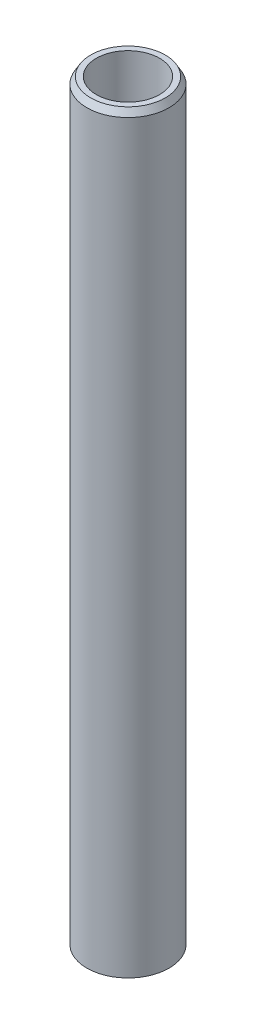
ISO-10303-21;
HEADER;
FILE_DESCRIPTION(('STEP AP214'),'2;1');
FILE_NAME('part.step','',(''),(''),'','','');
FILE_SCHEMA(('AUTOMOTIVE_DESIGN { 1 0 10303 214 1 1 1 1 }'));
ENDSEC;
DATA;
#1=APPLICATION_CONTEXT('core data for automotive mechanical design processes');
#2=APPLICATION_PROTOCOL_DEFINITION('international standard','automotive_design',2000,#1);
#3=PRODUCT_CONTEXT('',#1,'mechanical');
#4=PRODUCT('Part','Part','',(#3));
#5=PRODUCT_RELATED_PRODUCT_CATEGORY('part','',(#4));
#6=PRODUCT_DEFINITION_FORMATION('','',#4);
#7=PRODUCT_DEFINITION_CONTEXT('part definition',#1,'design');
#8=PRODUCT_DEFINITION('design','',#6,#7);
#9=PRODUCT_DEFINITION_SHAPE('','',#8);
#10=(LENGTH_UNIT() NAMED_UNIT(*) SI_UNIT(.MILLI.,.METRE.));
#11=(NAMED_UNIT(*) PLANE_ANGLE_UNIT() SI_UNIT($,.RADIAN.));
#12=(NAMED_UNIT(*) SI_UNIT($,.STERADIAN.) SOLID_ANGLE_UNIT());
#13=UNCERTAINTY_MEASURE_WITH_UNIT(LENGTH_MEASURE(1.E-05),#10,'distance_accuracy_value','');
#14=(GEOMETRIC_REPRESENTATION_CONTEXT(3) GLOBAL_UNCERTAINTY_ASSIGNED_CONTEXT((#13)) GLOBAL_UNIT_ASSIGNED_CONTEXT((#10,
#11,#12)) REPRESENTATION_CONTEXT('',''));
#15=CARTESIAN_POINT('',(0.,0.,0.));
#16=DIRECTION('',(0.,0.,1.));
#17=DIRECTION('',(1.,0.,0.));
#18=AXIS2_PLACEMENT_3D('',#15,#16,#17);
#19=CARTESIAN_POINT('',(0.,321.885524198242,0.));
#20=DIRECTION('',(0.,-1.,0.));
#21=DIRECTION('',(0.,0.,-1.));
#22=AXIS2_PLACEMENT_3D('',#19,#20,#21);
#23=CYLINDRICAL_SURFACE('',#22,17.5);
#24=CARTESIAN_POINT('',(0.,319.067785620837,0.));
#25=DIRECTION('',(0.,1.,0.));
#26=DIRECTION('',(0.,0.,1.));
#27=AXIS2_PLACEMENT_3D('',#24,#25,#26);
#28=CIRCLE('',#27,17.5);
#29=CARTESIAN_POINT('',(0.,319.067785620837,17.5));
#30=VERTEX_POINT('',#29);
#31=EDGE_CURVE('E50',#30,#30,#28,.F.);
#32=ORIENTED_EDGE('',*,*,#31,.T.);
#33=EDGE_LOOP('',(#32));
#34=FACE_BOUND('',#33,.T.);
#35=CARTESIAN_POINT('',(0.,1.62682212617055,0.));
#36=DIRECTION('',(0.,1.,0.));
#37=DIRECTION('',(0.,0.,1.));
#38=AXIS2_PLACEMENT_3D('',#35,#36,#37);
#39=CIRCLE('',#38,17.5);
#40=CARTESIAN_POINT('',(0.,1.62682212617055,17.5));
#41=VERTEX_POINT('',#40);
#42=EDGE_CURVE('E51',#41,#41,#39,.T.);
#43=ORIENTED_EDGE('',*,*,#42,.T.);
#44=EDGE_LOOP('',(#43));
#45=FACE_BOUND('',#44,.T.);
#46=ADVANCED_FACE('F39',(#34,#45),#23,.T.);
#47=CARTESIAN_POINT('',(0.,321.885524198242,0.));
#48=DIRECTION('',(0.,1.,0.));
#49=DIRECTION('',(0.,0.,1.));
#50=AXIS2_PLACEMENT_3D('',#47,#48,#49);
#51=PLANE('',#50);
#52=CARTESIAN_POINT('',(0.,321.885524198242,0.));
#53=DIRECTION('',(0.,1.,0.));
#54=DIRECTION('',(0.,0.,1.));
#55=AXIS2_PLACEMENT_3D('',#52,#53,#54);
#56=CIRCLE('',#55,15.8731778738294);
#57=CARTESIAN_POINT('',(0.,321.885524198242,15.8731778738294));
#58=VERTEX_POINT('',#57);
#59=EDGE_CURVE('E54',#58,#58,#56,.T.);
#60=ORIENTED_EDGE('',*,*,#59,.T.);
#61=EDGE_LOOP('',(#60));
#62=FACE_BOUND('',#61,.T.);
#63=CARTESIAN_POINT('',(0.,321.885524198242,0.));
#64=DIRECTION('',(0.,1.,0.));
#65=DIRECTION('',(0.,0.,1.));
#66=AXIS2_PLACEMENT_3D('',#63,#64,#65);
#67=CIRCLE('',#66,13.4563874358037);
#68=CARTESIAN_POINT('',(0.,321.885524198242,13.4563874358037));
#69=VERTEX_POINT('',#68);
#70=EDGE_CURVE('E58',#69,#69,#67,.T.);
#71=ORIENTED_EDGE('',*,*,#70,.F.);
#72=EDGE_LOOP('',(#71));
#73=FACE_BOUND('',#72,.T.);
#74=ADVANCED_FACE('F69',(#62,#73),#51,.T.);
#75=CARTESIAN_POINT('',(0.,0.,0.));
#76=DIRECTION('',(0.,1.,0.));
#77=DIRECTION('',(0.,0.,1.));
#78=AXIS2_PLACEMENT_3D('',#75,#76,#77);
#79=PLANE('',#78);
#80=CARTESIAN_POINT('',(0.,0.,0.));
#81=DIRECTION('',(0.,1.,0.));
#82=DIRECTION('',(0.,0.,1.));
#83=AXIS2_PLACEMENT_3D('',#80,#81,#82);
#84=CIRCLE('',#83,14.6822614225954);
#85=CARTESIAN_POINT('',(0.,0.,14.6822614225954));
#86=VERTEX_POINT('',#85);
#87=EDGE_CURVE('E10',#86,#86,#84,.F.);
#88=ORIENTED_EDGE('',*,*,#87,.T.);
#89=EDGE_LOOP('',(#88));
#90=FACE_BOUND('',#89,.T.);
#91=CARTESIAN_POINT('',(0.,0.,0.));
#92=DIRECTION('',(0.,1.,0.));
#93=DIRECTION('',(0.,0.,1.));
#94=AXIS2_PLACEMENT_3D('',#91,#92,#93);
#95=CIRCLE('',#94,13.4563874358037);
#96=CARTESIAN_POINT('',(0.,0.,13.4563874358037));
#97=VERTEX_POINT('',#96);
#98=EDGE_CURVE('E63',#97,#97,#95,.T.);
#99=ORIENTED_EDGE('',*,*,#98,.T.);
#100=EDGE_LOOP('',(#99));
#101=FACE_BOUND('',#100,.T.);
#102=ADVANCED_FACE('F75',(#90,#101),#79,.F.);
#103=CARTESIAN_POINT('',(0.,321.885524198242,0.));
#104=DIRECTION('',(0.,-1.,0.));
#105=DIRECTION('',(0.,0.,-1.));
#106=AXIS2_PLACEMENT_3D('',#103,#104,#105);
#107=CYLINDRICAL_SURFACE('',#106,13.4563874358037);
#108=ORIENTED_EDGE('',*,*,#70,.T.);
#109=EDGE_LOOP('',(#108));
#110=FACE_BOUND('',#109,.T.);
#111=ORIENTED_EDGE('',*,*,#98,.F.);
#112=EDGE_LOOP('',(#111));
#113=FACE_BOUND('',#112,.T.);
#114=ADVANCED_FACE('F70',(#110,#113),#107,.F.);
#115=CARTESIAN_POINT('',(0.,321.885524198242,0.));
#116=DIRECTION('',(0.,-1.,0.));
#117=DIRECTION('',(0.,0.,-1.));
#118=AXIS2_PLACEMENT_3D('',#115,#116,#117);
#119=CONICAL_SURFACE('',#118,15.8731778738294,0.523598775598306);
#120=ORIENTED_EDGE('',*,*,#31,.F.);
#121=EDGE_LOOP('',(#120));
#122=FACE_BOUND('',#121,.T.);
#123=ORIENTED_EDGE('',*,*,#59,.F.);
#124=EDGE_LOOP('',(#123));
#125=FACE_BOUND('',#124,.T.);
#126=ADVANCED_FACE('F81',(#122,#125),#119,.T.);
#127=CARTESIAN_POINT('',(0.,1.62682212617055,0.));
#128=DIRECTION('',(0.,1.,0.));
#129=DIRECTION('',(0.,0.,1.));
#130=AXIS2_PLACEMENT_3D('',#127,#128,#129);
#131=CONICAL_SURFACE('',#130,17.5,1.0471975511966);
#132=ORIENTED_EDGE('',*,*,#87,.F.);
#133=EDGE_LOOP('',(#132));
#134=FACE_BOUND('',#133,.T.);
#135=ORIENTED_EDGE('',*,*,#42,.F.);
#136=EDGE_LOOP('',(#135));
#137=FACE_BOUND('',#136,.T.);
#138=ADVANCED_FACE('F45',(#134,#137),#131,.T.);
#139=CLOSED_SHELL('',(#46,#74,#102,#114,#126,#138));
#140=MANIFOLD_SOLID_BREP('B2',#139);
#141=ADVANCED_BREP_SHAPE_REPRESENTATION('',(#18,#140),#14);
#142=SHAPE_DEFINITION_REPRESENTATION(#9,#141);
ENDSEC;
END-ISO-10303-21;
